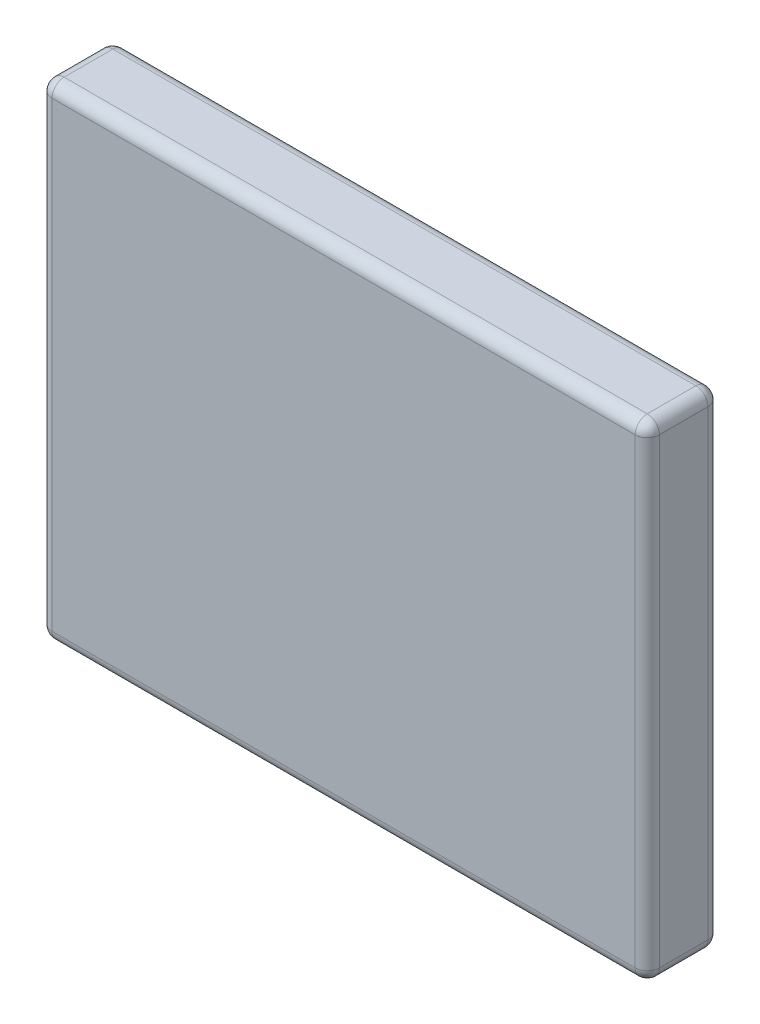
ISO-10303-21;
HEADER;
FILE_DESCRIPTION(('STEP AP214'),'2;1');
FILE_NAME('part.step','',(''),(''),'','','');
FILE_SCHEMA(('AUTOMOTIVE_DESIGN { 1 0 10303 214 1 1 1 1 }'));
ENDSEC;
DATA;
#1=APPLICATION_CONTEXT('core data for automotive mechanical design processes');
#2=APPLICATION_PROTOCOL_DEFINITION('international standard','automotive_design',2000,#1);
#3=PRODUCT_CONTEXT('',#1,'mechanical');
#4=PRODUCT('Part','Part','',(#3));
#5=PRODUCT_RELATED_PRODUCT_CATEGORY('part','',(#4));
#6=PRODUCT_DEFINITION_FORMATION('','',#4);
#7=PRODUCT_DEFINITION_CONTEXT('part definition',#1,'design');
#8=PRODUCT_DEFINITION('design','',#6,#7);
#9=PRODUCT_DEFINITION_SHAPE('','',#8);
#10=(LENGTH_UNIT() NAMED_UNIT(*) SI_UNIT(.MILLI.,.METRE.));
#11=(NAMED_UNIT(*) PLANE_ANGLE_UNIT() SI_UNIT($,.RADIAN.));
#12=(NAMED_UNIT(*) SI_UNIT($,.STERADIAN.) SOLID_ANGLE_UNIT());
#13=UNCERTAINTY_MEASURE_WITH_UNIT(LENGTH_MEASURE(1.E-05),#10,'distance_accuracy_value','');
#14=(GEOMETRIC_REPRESENTATION_CONTEXT(3) GLOBAL_UNCERTAINTY_ASSIGNED_CONTEXT((#13)) GLOBAL_UNIT_ASSIGNED_CONTEXT((#10,
#11,#12)) REPRESENTATION_CONTEXT('',''));
#15=CARTESIAN_POINT('',(0.,0.,0.));
#16=DIRECTION('',(0.,0.,1.));
#17=DIRECTION('',(1.,0.,0.));
#18=AXIS2_PLACEMENT_3D('',#15,#16,#17);
#19=CARTESIAN_POINT('',(-72.,-38.0319715955105,-3.));
#20=DIRECTION('',(0.,1.,0.));
#21=DIRECTION('',(-1.,0.,0.));
#22=AXIS2_PLACEMENT_3D('',#19,#20,#21);
#23=PLANE('',#22);
#24=DIRECTION('',(1.,0.,0.));
#25=VECTOR('',#24,1.);
#26=CARTESIAN_POINT('',(-47.,-38.0319715955105,-2.5));
#27=LINE('',#26,#25);
#28=CARTESIAN_POINT('',(-71.5,-38.0319715955105,-2.5));
#29=VERTEX_POINT('',#28);
#30=CARTESIAN_POINT('',(-47.5,-38.0319715955105,-2.5));
#31=VERTEX_POINT('',#30);
#32=EDGE_CURVE('E161',#29,#31,#27,.T.);
#33=ORIENTED_EDGE('',*,*,#32,.F.);
#34=DIRECTION('',(0.,0.,1.));
#35=VECTOR('',#34,1.);
#36=CARTESIAN_POINT('',(-71.5,-38.0319715955105,-3.));
#37=LINE('',#36,#35);
#38=CARTESIAN_POINT('',(-71.5,-38.0319715955105,-0.5));
#39=VERTEX_POINT('',#38);
#40=EDGE_CURVE('E144',#39,#29,#37,.F.);
#41=ORIENTED_EDGE('',*,*,#40,.F.);
#42=DIRECTION('',(1.,0.,0.));
#43=VECTOR('',#42,1.);
#44=CARTESIAN_POINT('',(-72.,-38.0319715955105,-0.5));
#45=LINE('',#44,#43);
#46=CARTESIAN_POINT('',(-47.5,-38.0319715955105,-0.5));
#47=VERTEX_POINT('',#46);
#48=EDGE_CURVE('E153',#47,#39,#45,.F.);
#49=ORIENTED_EDGE('',*,*,#48,.F.);
#50=DIRECTION('',(0.,0.,1.));
#51=VECTOR('',#50,1.);
#52=CARTESIAN_POINT('',(-47.5,-38.0319715955105,-3.));
#53=LINE('',#52,#51);
#54=EDGE_CURVE('E160',#31,#47,#53,.T.);
#55=ORIENTED_EDGE('',*,*,#54,.F.);
#56=EDGE_LOOP('',(#33,#41,#49,#55));
#57=FACE_BOUND('',#56,.T.);
#58=ADVANCED_FACE('F35',(#57),#23,.T.);
#59=CARTESIAN_POINT('',(-72.,-38.0319715955105,-3.));
#60=DIRECTION('',(1.,0.,0.));
#61=DIRECTION('',(0.,0.,1.));
#62=AXIS2_PLACEMENT_3D('',#59,#60,#61);
#63=PLANE('',#62);
#64=DIRECTION('',(0.,-1.,0.));
#65=VECTOR('',#64,1.);
#66=CARTESIAN_POINT('',(-72.,-58.0319715955105,-0.5));
#67=LINE('',#66,#65);
#68=CARTESIAN_POINT('',(-72.,-38.5319715955105,-0.5));
#69=VERTEX_POINT('',#68);
#70=CARTESIAN_POINT('',(-72.,-57.5319715955105,-0.5));
#71=VERTEX_POINT('',#70);
#72=EDGE_CURVE('E185',#69,#71,#67,.T.);
#73=ORIENTED_EDGE('',*,*,#72,.F.);
#74=DIRECTION('',(0.,0.,1.));
#75=VECTOR('',#74,1.);
#76=CARTESIAN_POINT('',(-72.,-38.5319715955105,0.));
#77=LINE('',#76,#75);
#78=CARTESIAN_POINT('',(-72.,-38.5319715955105,-2.5));
#79=VERTEX_POINT('',#78);
#80=EDGE_CURVE('E147',#79,#69,#77,.T.);
#81=ORIENTED_EDGE('',*,*,#80,.F.);
#82=DIRECTION('',(0.,-1.,0.));
#83=VECTOR('',#82,1.);
#84=CARTESIAN_POINT('',(-72.,-38.0319715955105,-2.5));
#85=LINE('',#84,#83);
#86=CARTESIAN_POINT('',(-72.,-57.5319715955105,-2.5));
#87=VERTEX_POINT('',#86);
#88=EDGE_CURVE('E182',#87,#79,#85,.F.);
#89=ORIENTED_EDGE('',*,*,#88,.F.);
#90=DIRECTION('',(0.,0.,1.));
#91=VECTOR('',#90,1.);
#92=CARTESIAN_POINT('',(-72.,-57.5319715955105,-3.));
#93=LINE('',#92,#91);
#94=EDGE_CURVE('E188',#71,#87,#93,.F.);
#95=ORIENTED_EDGE('',*,*,#94,.F.);
#96=EDGE_LOOP('',(#73,#81,#89,#95));
#97=FACE_BOUND('',#96,.T.);
#98=ADVANCED_FACE('F266',(#97),#63,.F.);
#99=CARTESIAN_POINT('',(-72.,-58.0319715955105,-3.));
#100=DIRECTION('',(0.,1.,0.));
#101=DIRECTION('',(0.,0.,-1.));
#102=AXIS2_PLACEMENT_3D('',#99,#100,#101);
#103=PLANE('',#102);
#104=DIRECTION('',(1.,0.,0.));
#105=VECTOR('',#104,1.);
#106=CARTESIAN_POINT('',(-47.,-58.0319715955105,-0.5));
#107=LINE('',#106,#105);
#108=CARTESIAN_POINT('',(-71.5,-58.0319715955105,-0.5));
#109=VERTEX_POINT('',#108);
#110=CARTESIAN_POINT('',(-47.5,-58.0319715955105,-0.5));
#111=VERTEX_POINT('',#110);
#112=EDGE_CURVE('E206',#109,#111,#107,.T.);
#113=ORIENTED_EDGE('',*,*,#112,.F.);
#114=DIRECTION('',(0.,0.,1.));
#115=VECTOR('',#114,1.);
#116=CARTESIAN_POINT('',(-71.5,-58.0319715955105,-3.));
#117=LINE('',#116,#115);
#118=CARTESIAN_POINT('',(-71.5,-58.0319715955105,-2.5));
#119=VERTEX_POINT('',#118);
#120=EDGE_CURVE('E201',#119,#109,#117,.T.);
#121=ORIENTED_EDGE('',*,*,#120,.F.);
#122=DIRECTION('',(1.,0.,0.));
#123=VECTOR('',#122,1.);
#124=CARTESIAN_POINT('',(-72.,-58.0319715955105,-2.5));
#125=LINE('',#124,#123);
#126=CARTESIAN_POINT('',(-47.5,-58.0319715955105,-2.5));
#127=VERTEX_POINT('',#126);
#128=EDGE_CURVE('E204',#127,#119,#125,.F.);
#129=ORIENTED_EDGE('',*,*,#128,.F.);
#130=DIRECTION('',(0.,0.,1.));
#131=VECTOR('',#130,1.);
#132=CARTESIAN_POINT('',(-47.5,-58.0319715955105,-3.));
#133=LINE('',#132,#131);
#134=EDGE_CURVE('E209',#111,#127,#133,.F.);
#135=ORIENTED_EDGE('',*,*,#134,.F.);
#136=EDGE_LOOP('',(#113,#121,#129,#135));
#137=FACE_BOUND('',#136,.T.);
#138=ADVANCED_FACE('F306',(#137),#103,.F.);
#139=CARTESIAN_POINT('',(-47.,-38.0319715955105,-3.));
#140=DIRECTION('',(1.,0.,0.));
#141=DIRECTION('',(0.,0.,1.));
#142=AXIS2_PLACEMENT_3D('',#139,#140,#141);
#143=PLANE('',#142);
#144=DIRECTION('',(0.,-1.,0.));
#145=VECTOR('',#144,1.);
#146=CARTESIAN_POINT('',(-47.,-38.0319715955105,-0.5));
#147=LINE('',#146,#145);
#148=CARTESIAN_POINT('',(-47.,-57.5319715955105,-0.5));
#149=VERTEX_POINT('',#148);
#150=CARTESIAN_POINT('',(-47.,-38.5319715955105,-0.5));
#151=VERTEX_POINT('',#150);
#152=EDGE_CURVE('E175',#149,#151,#147,.F.);
#153=ORIENTED_EDGE('',*,*,#152,.F.);
#154=DIRECTION('',(0.,0.,1.));
#155=VECTOR('',#154,1.);
#156=CARTESIAN_POINT('',(-47.,-57.5319715955105,0.));
#157=LINE('',#156,#155);
#158=CARTESIAN_POINT('',(-47.,-57.5319715955105,-2.5));
#159=VERTEX_POINT('',#158);
#160=EDGE_CURVE('E170',#159,#149,#157,.T.);
#161=ORIENTED_EDGE('',*,*,#160,.F.);
#162=DIRECTION('',(0.,-1.,0.));
#163=VECTOR('',#162,1.);
#164=CARTESIAN_POINT('',(-47.,-58.0319715955105,-2.5));
#165=LINE('',#164,#163);
#166=CARTESIAN_POINT('',(-47.,-38.5319715955105,-2.5));
#167=VERTEX_POINT('',#166);
#168=EDGE_CURVE('E173',#167,#159,#165,.T.);
#169=ORIENTED_EDGE('',*,*,#168,.F.);
#170=DIRECTION('',(0.,0.,1.));
#171=VECTOR('',#170,1.);
#172=CARTESIAN_POINT('',(-47.,-38.5319715955105,-3.));
#173=LINE('',#172,#171);
#174=EDGE_CURVE('E178',#151,#167,#173,.F.);
#175=ORIENTED_EDGE('',*,*,#174,.F.);
#176=EDGE_LOOP('',(#153,#161,#169,#175));
#177=FACE_BOUND('',#176,.T.);
#178=ADVANCED_FACE('F326',(#177),#143,.T.);
#179=CARTESIAN_POINT('',(0.,0.,-3.));
#180=DIRECTION('',(0.,0.,1.));
#181=DIRECTION('',(-1.,0.,0.));
#182=AXIS2_PLACEMENT_3D('',#179,#180,#181);
#183=PLANE('',#182);
#184=DIRECTION('',(1.,0.,0.));
#185=VECTOR('',#184,1.);
#186=CARTESIAN_POINT('',(0.,-57.5319715955105,-3.));
#187=LINE('',#186,#185);
#188=CARTESIAN_POINT('',(-71.5,-57.5319715955105,-3.));
#189=VERTEX_POINT('',#188);
#190=CARTESIAN_POINT('',(-47.5,-57.5319715955105,-3.));
#191=VERTEX_POINT('',#190);
#192=EDGE_CURVE('E44',#189,#191,#187,.T.);
#193=ORIENTED_EDGE('',*,*,#192,.F.);
#194=DIRECTION('',(0.,-1.,0.));
#195=VECTOR('',#194,1.);
#196=CARTESIAN_POINT('',(-71.5,0.,-3.));
#197=LINE('',#196,#195);
#198=CARTESIAN_POINT('',(-71.5,-38.5319715955105,-3.));
#199=VERTEX_POINT('',#198);
#200=EDGE_CURVE('E215',#199,#189,#197,.T.);
#201=ORIENTED_EDGE('',*,*,#200,.F.);
#202=DIRECTION('',(1.,0.,0.));
#203=VECTOR('',#202,1.);
#204=CARTESIAN_POINT('',(-72.,-38.5319715955105,-3.));
#205=LINE('',#204,#203);
#206=CARTESIAN_POINT('',(-47.5,-38.5319715955105,-3.));
#207=VERTEX_POINT('',#206);
#208=EDGE_CURVE('E212',#207,#199,#205,.F.);
#209=ORIENTED_EDGE('',*,*,#208,.F.);
#210=DIRECTION('',(0.,-1.,0.));
#211=VECTOR('',#210,1.);
#212=CARTESIAN_POINT('',(-47.5,-38.0319715955105,-3.));
#213=LINE('',#212,#211);
#214=EDGE_CURVE('E11',#191,#207,#213,.F.);
#215=ORIENTED_EDGE('',*,*,#214,.F.);
#216=EDGE_LOOP('',(#193,#201,#209,#215));
#217=FACE_BOUND('',#216,.T.);
#218=ADVANCED_FACE('F491',(#217),#183,.F.);
#219=CARTESIAN_POINT('',(0.,0.,0.));
#220=DIRECTION('',(0.,0.,1.));
#221=DIRECTION('',(-1.,0.,0.));
#222=AXIS2_PLACEMENT_3D('',#219,#220,#221);
#223=PLANE('',#222);
#224=DIRECTION('',(1.,0.,0.));
#225=VECTOR('',#224,1.);
#226=CARTESIAN_POINT('',(-72.,-57.5319715955105,0.));
#227=LINE('',#226,#225);
#228=CARTESIAN_POINT('',(-47.5,-57.5319715955105,0.));
#229=VERTEX_POINT('',#228);
#230=CARTESIAN_POINT('',(-71.5,-57.5319715955105,0.));
#231=VERTEX_POINT('',#230);
#232=EDGE_CURVE('E196',#229,#231,#227,.F.);
#233=ORIENTED_EDGE('',*,*,#232,.F.);
#234=DIRECTION('',(0.,-1.,0.));
#235=VECTOR('',#234,1.);
#236=CARTESIAN_POINT('',(-47.5,0.,0.));
#237=LINE('',#236,#235);
#238=CARTESIAN_POINT('',(-47.5,-38.5319715955105,0.));
#239=VERTEX_POINT('',#238);
#240=EDGE_CURVE('E193',#239,#229,#237,.T.);
#241=ORIENTED_EDGE('',*,*,#240,.F.);
#242=DIRECTION('',(1.,0.,0.));
#243=VECTOR('',#242,1.);
#244=CARTESIAN_POINT('',(0.,-38.5319715955105,0.));
#245=LINE('',#244,#243);
#246=CARTESIAN_POINT('',(-71.5,-38.5319715955105,0.));
#247=VERTEX_POINT('',#246);
#248=EDGE_CURVE('E191',#247,#239,#245,.T.);
#249=ORIENTED_EDGE('',*,*,#248,.F.);
#250=DIRECTION('',(0.,-1.,0.));
#251=VECTOR('',#250,1.);
#252=CARTESIAN_POINT('',(-71.5,-38.0319715955105,0.));
#253=LINE('',#252,#251);
#254=EDGE_CURVE('E199',#231,#247,#253,.F.);
#255=ORIENTED_EDGE('',*,*,#254,.F.);
#256=EDGE_LOOP('',(#233,#241,#249,#255));
#257=FACE_BOUND('',#256,.T.);
#258=ADVANCED_FACE('F274',(#257),#223,.T.);
#259=CARTESIAN_POINT('',(-71.5,-57.5319715955105,-3.));
#260=DIRECTION('',(0.,0.,1.));
#261=DIRECTION('',(-1.,0.,0.));
#262=AXIS2_PLACEMENT_3D('',#259,#260,#261);
#263=CYLINDRICAL_SURFACE('',#262,0.5);
#264=CARTESIAN_POINT('',(-71.5,-57.5319715955105,-2.5));
#265=DIRECTION('',(0.,0.,1.));
#266=DIRECTION('',(1.,0.,0.));
#267=AXIS2_PLACEMENT_3D('',#264,#265,#266);
#268=CIRCLE('',#267,0.5);
#269=EDGE_CURVE('E39',#87,#119,#268,.T.);
#270=ORIENTED_EDGE('',*,*,#269,.T.);
#271=ORIENTED_EDGE('',*,*,#120,.T.);
#272=CARTESIAN_POINT('',(-71.5,-57.5319715955105,-0.5));
#273=DIRECTION('',(0.,0.,-1.));
#274=DIRECTION('',(-1.,0.,0.));
#275=AXIS2_PLACEMENT_3D('',#272,#273,#274);
#276=CIRCLE('',#275,0.5);
#277=EDGE_CURVE('E167',#109,#71,#276,.T.);
#278=ORIENTED_EDGE('',*,*,#277,.T.);
#279=ORIENTED_EDGE('',*,*,#94,.T.);
#280=EDGE_LOOP('',(#270,#271,#278,#279));
#281=FACE_BOUND('',#280,.T.);
#282=ADVANCED_FACE('F37',(#281),#263,.T.);
#283=CARTESIAN_POINT('',(-71.5,-57.5319715955105,-2.5));
#284=DIRECTION('',(0.,-1.,0.));
#285=DIRECTION('',(0.,0.,1.));
#286=AXIS2_PLACEMENT_3D('',#283,#284,#285);
#287=SPHERICAL_SURFACE('',#286,0.5);
#288=CARTESIAN_POINT('',(-71.5,-57.5319715955105,-2.5));
#289=DIRECTION('',(0.,1.,0.));
#290=DIRECTION('',(0.,0.,1.));
#291=AXIS2_PLACEMENT_3D('',#288,#289,#290);
#292=CIRCLE('',#291,0.5);
#293=EDGE_CURVE('E255',#87,#189,#292,.F.);
#294=ORIENTED_EDGE('',*,*,#293,.T.);
#295=CARTESIAN_POINT('',(-71.5,-57.5319715955105,-2.5));
#296=DIRECTION('',(1.,0.,0.));
#297=DIRECTION('',(0.,0.,-1.));
#298=AXIS2_PLACEMENT_3D('',#295,#296,#297);
#299=CIRCLE('',#298,0.5);
#300=EDGE_CURVE('E59',#189,#119,#299,.F.);
#301=ORIENTED_EDGE('',*,*,#300,.T.);
#302=ORIENTED_EDGE('',*,*,#269,.F.);
#303=EDGE_LOOP('',(#294,#301,#302));
#304=FACE_BOUND('',#303,.T.);
#305=ADVANCED_FACE('F301',(#304),#287,.T.);
#306=CARTESIAN_POINT('',(-71.5,-57.5319715955105,-0.5));
#307=DIRECTION('',(-1.,0.,0.));
#308=DIRECTION('',(0.,0.,-1.));
#309=AXIS2_PLACEMENT_3D('',#306,#307,#308);
#310=SPHERICAL_SURFACE('',#309,0.5);
#311=CARTESIAN_POINT('',(-71.5,-57.5319715955105,-0.5));
#312=DIRECTION('',(1.,0.,0.));
#313=DIRECTION('',(0.,0.,-1.));
#314=AXIS2_PLACEMENT_3D('',#311,#312,#313);
#315=CIRCLE('',#314,0.5);
#316=EDGE_CURVE('E250',#109,#231,#315,.F.);
#317=ORIENTED_EDGE('',*,*,#316,.T.);
#318=CARTESIAN_POINT('',(-71.5,-57.5319715955105,-0.5));
#319=DIRECTION('',(0.,1.,0.));
#320=DIRECTION('',(0.,0.,1.));
#321=AXIS2_PLACEMENT_3D('',#318,#319,#320);
#322=CIRCLE('',#321,0.5);
#323=EDGE_CURVE('E253',#231,#71,#322,.F.);
#324=ORIENTED_EDGE('',*,*,#323,.T.);
#325=ORIENTED_EDGE('',*,*,#277,.F.);
#326=EDGE_LOOP('',(#317,#324,#325));
#327=FACE_BOUND('',#326,.T.);
#328=ADVANCED_FACE('F310',(#327),#310,.T.);
#329=CARTESIAN_POINT('',(0.,-57.5319715955105,-2.5));
#330=DIRECTION('',(1.,0.,0.));
#331=DIRECTION('',(0.,0.,1.));
#332=AXIS2_PLACEMENT_3D('',#329,#330,#331);
#333=CYLINDRICAL_SURFACE('',#332,0.5);
#334=ORIENTED_EDGE('',*,*,#300,.F.);
#335=ORIENTED_EDGE('',*,*,#192,.T.);
#336=CARTESIAN_POINT('',(-47.5,-57.5319715955105,-2.5));
#337=DIRECTION('',(-1.,0.,0.));
#338=DIRECTION('',(0.,0.,1.));
#339=AXIS2_PLACEMENT_3D('',#336,#337,#338);
#340=CIRCLE('',#339,0.5);
#341=EDGE_CURVE('E244',#191,#127,#340,.T.);
#342=ORIENTED_EDGE('',*,*,#341,.T.);
#343=ORIENTED_EDGE('',*,*,#128,.T.);
#344=EDGE_LOOP('',(#334,#335,#342,#343));
#345=FACE_BOUND('',#344,.T.);
#346=ADVANCED_FACE('F303',(#345),#333,.T.);
#347=CARTESIAN_POINT('',(-71.5,0.,-2.5));
#348=DIRECTION('',(0.,-1.,0.));
#349=DIRECTION('',(0.,0.,1.));
#350=AXIS2_PLACEMENT_3D('',#347,#348,#349);
#351=CYLINDRICAL_SURFACE('',#350,0.5);
#352=ORIENTED_EDGE('',*,*,#293,.F.);
#353=ORIENTED_EDGE('',*,*,#88,.T.);
#354=CARTESIAN_POINT('',(-71.5,-38.5319715955105,-2.5));
#355=DIRECTION('',(0.,-1.,0.));
#356=DIRECTION('',(0.,0.,-1.));
#357=AXIS2_PLACEMENT_3D('',#354,#355,#356);
#358=CIRCLE('',#357,0.5);
#359=EDGE_CURVE('E241',#79,#199,#358,.T.);
#360=ORIENTED_EDGE('',*,*,#359,.T.);
#361=ORIENTED_EDGE('',*,*,#200,.T.);
#362=EDGE_LOOP('',(#352,#353,#360,#361));
#363=FACE_BOUND('',#362,.T.);
#364=ADVANCED_FACE('F297',(#363),#351,.T.);
#365=CARTESIAN_POINT('',(-71.5,-38.5319715955105,-3.));
#366=DIRECTION('',(0.,0.,-1.));
#367=DIRECTION('',(1.,0.,0.));
#368=AXIS2_PLACEMENT_3D('',#365,#366,#367);
#369=CYLINDRICAL_SURFACE('',#368,0.5);
#370=CARTESIAN_POINT('',(-71.5,-38.5319715955105,-0.5));
#371=DIRECTION('',(0.,0.,-1.));
#372=DIRECTION('',(-1.,0.,0.));
#373=AXIS2_PLACEMENT_3D('',#370,#371,#372);
#374=CIRCLE('',#373,0.5);
#375=EDGE_CURVE('E130',#69,#39,#374,.T.);
#376=ORIENTED_EDGE('',*,*,#375,.T.);
#377=ORIENTED_EDGE('',*,*,#40,.T.);
#378=CARTESIAN_POINT('',(-71.5,-38.5319715955105,-2.5));
#379=DIRECTION('',(0.,0.,1.));
#380=DIRECTION('',(1.,0.,0.));
#381=AXIS2_PLACEMENT_3D('',#378,#379,#380);
#382=CIRCLE('',#381,0.5);
#383=EDGE_CURVE('E149',#29,#79,#382,.T.);
#384=ORIENTED_EDGE('',*,*,#383,.T.);
#385=ORIENTED_EDGE('',*,*,#80,.T.);
#386=EDGE_LOOP('',(#376,#377,#384,#385));
#387=FACE_BOUND('',#386,.T.);
#388=ADVANCED_FACE('F142',(#387),#369,.T.);
#389=CARTESIAN_POINT('',(-71.5,-38.0319715955105,-0.5));
#390=DIRECTION('',(0.,1.,0.));
#391=DIRECTION('',(0.,0.,-1.));
#392=AXIS2_PLACEMENT_3D('',#389,#390,#391);
#393=CYLINDRICAL_SURFACE('',#392,0.5);
#394=ORIENTED_EDGE('',*,*,#323,.F.);
#395=ORIENTED_EDGE('',*,*,#254,.T.);
#396=CARTESIAN_POINT('',(-71.5,-38.5319715955105,-0.5));
#397=DIRECTION('',(0.,-1.,0.));
#398=DIRECTION('',(0.,0.,-1.));
#399=AXIS2_PLACEMENT_3D('',#396,#397,#398);
#400=CIRCLE('',#399,0.5);
#401=EDGE_CURVE('E132',#247,#69,#400,.T.);
#402=ORIENTED_EDGE('',*,*,#401,.T.);
#403=ORIENTED_EDGE('',*,*,#72,.T.);
#404=EDGE_LOOP('',(#394,#395,#402,#403));
#405=FACE_BOUND('',#404,.T.);
#406=ADVANCED_FACE('F268',(#405),#393,.T.);
#407=CARTESIAN_POINT('',(-72.,-57.5319715955105,-0.5));
#408=DIRECTION('',(-1.,0.,0.));
#409=DIRECTION('',(0.,0.,-1.));
#410=AXIS2_PLACEMENT_3D('',#407,#408,#409);
#411=CYLINDRICAL_SURFACE('',#410,0.5);
#412=ORIENTED_EDGE('',*,*,#316,.F.);
#413=ORIENTED_EDGE('',*,*,#112,.T.);
#414=CARTESIAN_POINT('',(-47.5,-57.5319715955105,-0.5));
#415=DIRECTION('',(-1.,0.,0.));
#416=DIRECTION('',(0.,0.,1.));
#417=AXIS2_PLACEMENT_3D('',#414,#415,#416);
#418=CIRCLE('',#417,0.5);
#419=EDGE_CURVE('E236',#111,#229,#418,.T.);
#420=ORIENTED_EDGE('',*,*,#419,.T.);
#421=ORIENTED_EDGE('',*,*,#232,.T.);
#422=EDGE_LOOP('',(#412,#413,#420,#421));
#423=FACE_BOUND('',#422,.T.);
#424=ADVANCED_FACE('F308',(#423),#411,.T.);
#425=CARTESIAN_POINT('',(-47.5,-57.5319715955105,-3.));
#426=DIRECTION('',(0.,0.,-1.));
#427=DIRECTION('',(1.,0.,0.));
#428=AXIS2_PLACEMENT_3D('',#425,#426,#427);
#429=CYLINDRICAL_SURFACE('',#428,0.5);
#430=CARTESIAN_POINT('',(-47.5,-57.5319715955105,-2.5));
#431=DIRECTION('',(0.,0.,1.));
#432=DIRECTION('',(1.,0.,0.));
#433=AXIS2_PLACEMENT_3D('',#430,#431,#432);
#434=CIRCLE('',#433,0.5);
#435=EDGE_CURVE('E247',#127,#159,#434,.T.);
#436=ORIENTED_EDGE('',*,*,#435,.T.);
#437=ORIENTED_EDGE('',*,*,#160,.T.);
#438=CARTESIAN_POINT('',(-47.5,-57.5319715955105,-0.5));
#439=DIRECTION('',(0.,0.,-1.));
#440=DIRECTION('',(-1.,0.,0.));
#441=AXIS2_PLACEMENT_3D('',#438,#439,#440);
#442=CIRCLE('',#441,0.5);
#443=EDGE_CURVE('E234',#149,#111,#442,.T.);
#444=ORIENTED_EDGE('',*,*,#443,.T.);
#445=ORIENTED_EDGE('',*,*,#134,.T.);
#446=EDGE_LOOP('',(#436,#437,#444,#445));
#447=FACE_BOUND('',#446,.T.);
#448=ADVANCED_FACE('F356',(#447),#429,.T.);
#449=CARTESIAN_POINT('',(-47.5,-57.5319715955105,-2.5));
#450=DIRECTION('',(0.,-1.,0.));
#451=DIRECTION('',(0.,0.,1.));
#452=AXIS2_PLACEMENT_3D('',#449,#450,#451);
#453=SPHERICAL_SURFACE('',#452,0.5);
#454=ORIENTED_EDGE('',*,*,#341,.F.);
#455=CARTESIAN_POINT('',(-47.5,-57.5319715955105,-2.5));
#456=DIRECTION('',(0.,1.,0.));
#457=DIRECTION('',(0.,0.,1.));
#458=AXIS2_PLACEMENT_3D('',#455,#456,#457);
#459=CIRCLE('',#458,0.5);
#460=EDGE_CURVE('E51',#191,#159,#459,.F.);
#461=ORIENTED_EDGE('',*,*,#460,.T.);
#462=ORIENTED_EDGE('',*,*,#435,.F.);
#463=EDGE_LOOP('',(#454,#461,#462));
#464=FACE_BOUND('',#463,.T.);
#465=ADVANCED_FACE('F353',(#464),#453,.T.);
#466=CARTESIAN_POINT('',(-71.5,-38.5319715955105,-2.5));
#467=DIRECTION('',(-1.,0.,0.));
#468=DIRECTION('',(0.,0.,-1.));
#469=AXIS2_PLACEMENT_3D('',#466,#467,#468);
#470=SPHERICAL_SURFACE('',#469,0.5);
#471=ORIENTED_EDGE('',*,*,#383,.F.);
#472=CARTESIAN_POINT('',(-71.5,-38.5319715955105,-2.5));
#473=DIRECTION('',(1.,0.,0.));
#474=DIRECTION('',(0.,0.,-1.));
#475=AXIS2_PLACEMENT_3D('',#472,#473,#474);
#476=CIRCLE('',#475,0.5);
#477=EDGE_CURVE('E137',#29,#199,#476,.F.);
#478=ORIENTED_EDGE('',*,*,#477,.T.);
#479=ORIENTED_EDGE('',*,*,#359,.F.);
#480=EDGE_LOOP('',(#471,#478,#479));
#481=FACE_BOUND('',#480,.T.);
#482=ADVANCED_FACE('F295',(#481),#470,.T.);
#483=CARTESIAN_POINT('',(-71.5,-38.5319715955105,-0.5));
#484=DIRECTION('',(-1.,0.,0.));
#485=DIRECTION('',(0.,0.,-1.));
#486=AXIS2_PLACEMENT_3D('',#483,#484,#485);
#487=SPHERICAL_SURFACE('',#486,0.5);
#488=ORIENTED_EDGE('',*,*,#401,.F.);
#489=CARTESIAN_POINT('',(-71.5,-38.5319715955105,-0.5));
#490=DIRECTION('',(1.,0.,0.));
#491=DIRECTION('',(0.,0.,-1.));
#492=AXIS2_PLACEMENT_3D('',#489,#490,#491);
#493=CIRCLE('',#492,0.5);
#494=EDGE_CURVE('E127',#247,#39,#493,.F.);
#495=ORIENTED_EDGE('',*,*,#494,.T.);
#496=ORIENTED_EDGE('',*,*,#375,.F.);
#497=EDGE_LOOP('',(#488,#495,#496));
#498=FACE_BOUND('',#497,.T.);
#499=ADVANCED_FACE('F129',(#498),#487,.T.);
#500=CARTESIAN_POINT('',(-47.5,-57.5319715955105,-0.5));
#501=DIRECTION('',(0.,-1.,0.));
#502=DIRECTION('',(0.,0.,1.));
#503=AXIS2_PLACEMENT_3D('',#500,#501,#502);
#504=SPHERICAL_SURFACE('',#503,0.5);
#505=ORIENTED_EDGE('',*,*,#443,.F.);
#506=CARTESIAN_POINT('',(-47.5,-57.5319715955105,-0.5));
#507=DIRECTION('',(0.,1.,0.));
#508=DIRECTION('',(0.,0.,1.));
#509=AXIS2_PLACEMENT_3D('',#506,#507,#508);
#510=CIRCLE('',#509,0.5);
#511=EDGE_CURVE('E138',#149,#229,#510,.F.);
#512=ORIENTED_EDGE('',*,*,#511,.T.);
#513=ORIENTED_EDGE('',*,*,#419,.F.);
#514=EDGE_LOOP('',(#505,#512,#513));
#515=FACE_BOUND('',#514,.T.);
#516=ADVANCED_FACE('F345',(#515),#504,.T.);
#517=CARTESIAN_POINT('',(-47.5,-38.0319715955105,-2.5));
#518=DIRECTION('',(0.,1.,0.));
#519=DIRECTION('',(0.,0.,-1.));
#520=AXIS2_PLACEMENT_3D('',#517,#518,#519);
#521=CYLINDRICAL_SURFACE('',#520,0.5);
#522=ORIENTED_EDGE('',*,*,#460,.F.);
#523=ORIENTED_EDGE('',*,*,#214,.T.);
#524=CARTESIAN_POINT('',(-47.5,-38.5319715955105,-2.5));
#525=DIRECTION('',(0.,-1.,0.));
#526=DIRECTION('',(0.,0.,-1.));
#527=AXIS2_PLACEMENT_3D('',#524,#525,#526);
#528=CIRCLE('',#527,0.5);
#529=EDGE_CURVE('E228',#207,#167,#528,.T.);
#530=ORIENTED_EDGE('',*,*,#529,.T.);
#531=ORIENTED_EDGE('',*,*,#168,.T.);
#532=EDGE_LOOP('',(#522,#523,#530,#531));
#533=FACE_BOUND('',#532,.T.);
#534=ADVANCED_FACE('F342',(#533),#521,.T.);
#535=CARTESIAN_POINT('',(-72.,-38.5319715955105,-2.5));
#536=DIRECTION('',(-1.,0.,0.));
#537=DIRECTION('',(0.,-1.,0.));
#538=AXIS2_PLACEMENT_3D('',#535,#536,#537);
#539=CYLINDRICAL_SURFACE('',#538,0.5);
#540=ORIENTED_EDGE('',*,*,#477,.F.);
#541=ORIENTED_EDGE('',*,*,#32,.T.);
#542=CARTESIAN_POINT('',(-47.5,-38.5319715955105,-2.5));
#543=DIRECTION('',(-1.,0.,0.));
#544=DIRECTION('',(0.,0.,1.));
#545=AXIS2_PLACEMENT_3D('',#542,#543,#544);
#546=CIRCLE('',#545,0.5);
#547=EDGE_CURVE('E226',#31,#207,#546,.T.);
#548=ORIENTED_EDGE('',*,*,#547,.T.);
#549=ORIENTED_EDGE('',*,*,#208,.T.);
#550=EDGE_LOOP('',(#540,#541,#548,#549));
#551=FACE_BOUND('',#550,.T.);
#552=ADVANCED_FACE('F288',(#551),#539,.T.);
#553=CARTESIAN_POINT('',(0.,-38.5319715955105,-0.5));
#554=DIRECTION('',(1.,0.,0.));
#555=DIRECTION('',(0.,1.,0.));
#556=AXIS2_PLACEMENT_3D('',#553,#554,#555);
#557=CYLINDRICAL_SURFACE('',#556,0.5);
#558=ORIENTED_EDGE('',*,*,#494,.F.);
#559=ORIENTED_EDGE('',*,*,#248,.T.);
#560=CARTESIAN_POINT('',(-47.5,-38.5319715955105,-0.5));
#561=DIRECTION('',(-1.,0.,0.));
#562=DIRECTION('',(0.,0.,1.));
#563=AXIS2_PLACEMENT_3D('',#560,#561,#562);
#564=CIRCLE('',#563,0.5);
#565=EDGE_CURVE('E156',#239,#47,#564,.T.);
#566=ORIENTED_EDGE('',*,*,#565,.T.);
#567=ORIENTED_EDGE('',*,*,#48,.T.);
#568=EDGE_LOOP('',(#558,#559,#566,#567));
#569=FACE_BOUND('',#568,.T.);
#570=ADVANCED_FACE('F154',(#569),#557,.T.);
#571=CARTESIAN_POINT('',(-47.5,0.,-0.5));
#572=DIRECTION('',(0.,-1.,0.));
#573=DIRECTION('',(0.,0.,1.));
#574=AXIS2_PLACEMENT_3D('',#571,#572,#573);
#575=CYLINDRICAL_SURFACE('',#574,0.5);
#576=ORIENTED_EDGE('',*,*,#511,.F.);
#577=ORIENTED_EDGE('',*,*,#152,.T.);
#578=CARTESIAN_POINT('',(-47.5,-38.5319715955105,-0.5));
#579=DIRECTION('',(0.,-1.,0.));
#580=DIRECTION('',(0.,0.,-1.));
#581=AXIS2_PLACEMENT_3D('',#578,#579,#580);
#582=CIRCLE('',#581,0.5);
#583=EDGE_CURVE('E223',#151,#239,#582,.T.);
#584=ORIENTED_EDGE('',*,*,#583,.T.);
#585=ORIENTED_EDGE('',*,*,#240,.T.);
#586=EDGE_LOOP('',(#576,#577,#584,#585));
#587=FACE_BOUND('',#586,.T.);
#588=ADVANCED_FACE('F276',(#587),#575,.T.);
#589=CARTESIAN_POINT('',(-47.5,-38.5319715955105,-2.5));
#590=DIRECTION('',(0.,0.,-1.));
#591=DIRECTION('',(1.,0.,0.));
#592=AXIS2_PLACEMENT_3D('',#589,#590,#591);
#593=SPHERICAL_SURFACE('',#592,0.5);
#594=ORIENTED_EDGE('',*,*,#547,.F.);
#595=CARTESIAN_POINT('',(-47.5,-38.5319715955105,-2.5));
#596=DIRECTION('',(0.,0.,1.));
#597=DIRECTION('',(1.,0.,0.));
#598=AXIS2_PLACEMENT_3D('',#595,#596,#597);
#599=CIRCLE('',#598,0.5);
#600=EDGE_CURVE('E221',#31,#167,#599,.F.);
#601=ORIENTED_EDGE('',*,*,#600,.T.);
#602=ORIENTED_EDGE('',*,*,#529,.F.);
#603=EDGE_LOOP('',(#594,#601,#602));
#604=FACE_BOUND('',#603,.T.);
#605=ADVANCED_FACE('F332',(#604),#593,.T.);
#606=CARTESIAN_POINT('',(-47.5,-38.5319715955105,-0.5));
#607=DIRECTION('',(0.,0.,1.));
#608=DIRECTION('',(-1.,0.,0.));
#609=AXIS2_PLACEMENT_3D('',#606,#607,#608);
#610=SPHERICAL_SURFACE('',#609,0.5);
#611=ORIENTED_EDGE('',*,*,#583,.F.);
#612=CARTESIAN_POINT('',(-47.5,-38.5319715955105,-0.5));
#613=DIRECTION('',(0.,0.,-1.));
#614=DIRECTION('',(-1.,0.,0.));
#615=AXIS2_PLACEMENT_3D('',#612,#613,#614);
#616=CIRCLE('',#615,0.5);
#617=EDGE_CURVE('E219',#151,#47,#616,.F.);
#618=ORIENTED_EDGE('',*,*,#617,.T.);
#619=ORIENTED_EDGE('',*,*,#565,.F.);
#620=EDGE_LOOP('',(#611,#618,#619));
#621=FACE_BOUND('',#620,.T.);
#622=ADVANCED_FACE('F282',(#621),#610,.T.);
#623=CARTESIAN_POINT('',(-47.5,-38.5319715955105,-3.));
#624=DIRECTION('',(0.,0.,1.));
#625=DIRECTION('',(-1.,0.,0.));
#626=AXIS2_PLACEMENT_3D('',#623,#624,#625);
#627=CYLINDRICAL_SURFACE('',#626,0.5);
#628=ORIENTED_EDGE('',*,*,#600,.F.);
#629=ORIENTED_EDGE('',*,*,#54,.T.);
#630=ORIENTED_EDGE('',*,*,#617,.F.);
#631=ORIENTED_EDGE('',*,*,#174,.T.);
#632=EDGE_LOOP('',(#628,#629,#630,#631));
#633=FACE_BOUND('',#632,.T.);
#634=ADVANCED_FACE('F284',(#633),#627,.T.);
#635=CLOSED_SHELL('',(#58,#98,#138,#178,#218,#258,#282,#305,#328,#346,#364,#388,#406,#424,#448,
#465,#482,#499,#516,#534,#552,#570,#588,#605,#622,#634));
#636=MANIFOLD_SOLID_BREP('B2',#635);
#637=ADVANCED_BREP_SHAPE_REPRESENTATION('',(#18,#636),#14);
#638=SHAPE_DEFINITION_REPRESENTATION(#9,#637);
ENDSEC;
END-ISO-10303-21;
